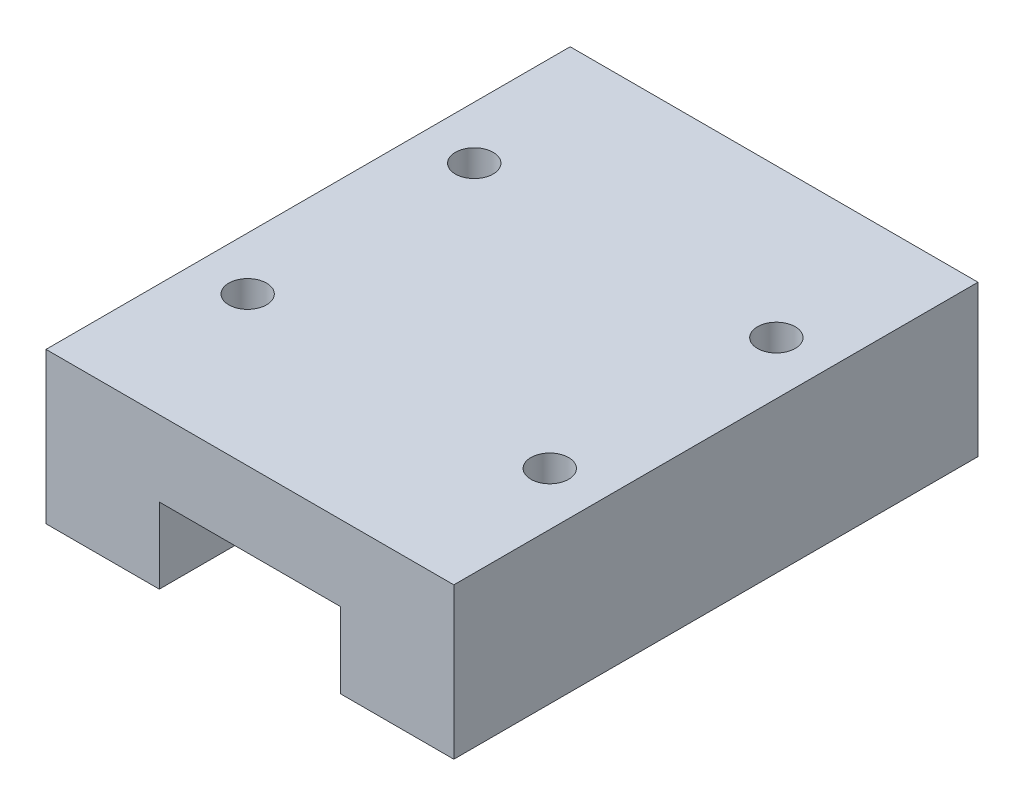
ISO-10303-21;
HEADER;
FILE_DESCRIPTION(('STEP AP214'),'2;1');
FILE_NAME('part.step','',(''),(''),'','','');
FILE_SCHEMA(('AUTOMOTIVE_DESIGN { 1 0 10303 214 1 1 1 1 }'));
ENDSEC;
DATA;
#1=APPLICATION_CONTEXT('core data for automotive mechanical design processes');
#2=APPLICATION_PROTOCOL_DEFINITION('international standard','automotive_design',2000,#1);
#3=PRODUCT_CONTEXT('',#1,'mechanical');
#4=PRODUCT('Part','Part','',(#3));
#5=PRODUCT_RELATED_PRODUCT_CATEGORY('part','',(#4));
#6=PRODUCT_DEFINITION_FORMATION('','',#4);
#7=PRODUCT_DEFINITION_CONTEXT('part definition',#1,'design');
#8=PRODUCT_DEFINITION('design','',#6,#7);
#9=PRODUCT_DEFINITION_SHAPE('','',#8);
#10=(LENGTH_UNIT() NAMED_UNIT(*) SI_UNIT(.MILLI.,.METRE.));
#11=(NAMED_UNIT(*) PLANE_ANGLE_UNIT() SI_UNIT($,.RADIAN.));
#12=(NAMED_UNIT(*) SI_UNIT($,.STERADIAN.) SOLID_ANGLE_UNIT());
#13=UNCERTAINTY_MEASURE_WITH_UNIT(LENGTH_MEASURE(1.E-05),#10,'distance_accuracy_value','');
#14=(GEOMETRIC_REPRESENTATION_CONTEXT(3) GLOBAL_UNCERTAINTY_ASSIGNED_CONTEXT((#13)) GLOBAL_UNIT_ASSIGNED_CONTEXT((#10,
#11,#12)) REPRESENTATION_CONTEXT('',''));
#15=CARTESIAN_POINT('',(0.,0.,0.));
#16=DIRECTION('',(0.,0.,1.));
#17=DIRECTION('',(1.,0.,0.));
#18=AXIS2_PLACEMENT_3D('',#15,#16,#17);
#19=CARTESIAN_POINT('',(7.5,0.,34.7));
#20=DIRECTION('',(0.,1.,0.));
#21=DIRECTION('',(-1.,0.,0.));
#22=AXIS2_PLACEMENT_3D('',#19,#20,#21);
#23=PLANE('',#22);
#24=DIRECTION('',(1.,0.,0.));
#25=VECTOR('',#24,1.);
#26=CARTESIAN_POINT('',(7.5,0.,0.));
#27=LINE('',#26,#25);
#28=CARTESIAN_POINT('',(0.,0.,0.));
#29=VERTEX_POINT('',#28);
#30=CARTESIAN_POINT('',(7.5,0.,0.));
#31=VERTEX_POINT('',#30);
#32=EDGE_CURVE('E148',#29,#31,#27,.T.);
#33=ORIENTED_EDGE('',*,*,#32,.T.);
#34=DIRECTION('',(0.,0.,-1.));
#35=VECTOR('',#34,1.);
#36=CARTESIAN_POINT('',(7.5,0.,34.7));
#37=LINE('',#36,#35);
#38=CARTESIAN_POINT('',(7.5,0.,34.7));
#39=VERTEX_POINT('',#38);
#40=EDGE_CURVE('E11',#39,#31,#37,.T.);
#41=ORIENTED_EDGE('',*,*,#40,.F.);
#42=DIRECTION('',(1.,0.,0.));
#43=VECTOR('',#42,1.);
#44=CARTESIAN_POINT('',(7.5,0.,34.7));
#45=LINE('',#44,#43);
#46=CARTESIAN_POINT('',(0.,0.,34.7));
#47=VERTEX_POINT('',#46);
#48=EDGE_CURVE('E170',#47,#39,#45,.T.);
#49=ORIENTED_EDGE('',*,*,#48,.F.);
#50=DIRECTION('',(0.,0.,-1.));
#51=VECTOR('',#50,1.);
#52=CARTESIAN_POINT('',(0.,0.,34.7));
#53=LINE('',#52,#51);
#54=EDGE_CURVE('E144',#47,#29,#53,.T.);
#55=ORIENTED_EDGE('',*,*,#54,.T.);
#56=EDGE_LOOP('',(#33,#41,#49,#55));
#57=FACE_BOUND('',#56,.T.);
#58=ADVANCED_FACE('F42',(#57),#23,.F.);
#59=CARTESIAN_POINT('',(7.5,5.,34.7));
#60=DIRECTION('',(-1.,0.,0.));
#61=DIRECTION('',(0.,-1.,0.));
#62=AXIS2_PLACEMENT_3D('',#59,#60,#61);
#63=PLANE('',#62);
#64=DIRECTION('',(0.,1.,0.));
#65=VECTOR('',#64,1.);
#66=CARTESIAN_POINT('',(7.5,5.,0.));
#67=LINE('',#66,#65);
#68=CARTESIAN_POINT('',(7.5,5.,0.));
#69=VERTEX_POINT('',#68);
#70=EDGE_CURVE('E152',#31,#69,#67,.T.);
#71=ORIENTED_EDGE('',*,*,#70,.T.);
#72=DIRECTION('',(0.,0.,-1.));
#73=VECTOR('',#72,1.);
#74=CARTESIAN_POINT('',(7.5,5.,34.7));
#75=LINE('',#74,#73);
#76=CARTESIAN_POINT('',(7.5,5.,34.7));
#77=VERTEX_POINT('',#76);
#78=EDGE_CURVE('E51',#77,#69,#75,.T.);
#79=ORIENTED_EDGE('',*,*,#78,.F.);
#80=DIRECTION('',(0.,1.,0.));
#81=VECTOR('',#80,1.);
#82=CARTESIAN_POINT('',(7.5,5.,34.7));
#83=LINE('',#82,#81);
#84=EDGE_CURVE('E103',#39,#77,#83,.T.);
#85=ORIENTED_EDGE('',*,*,#84,.F.);
#86=ORIENTED_EDGE('',*,*,#40,.T.);
#87=EDGE_LOOP('',(#71,#79,#85,#86));
#88=FACE_BOUND('',#87,.T.);
#89=ADVANCED_FACE('F274',(#88),#63,.F.);
#90=CARTESIAN_POINT('',(19.5,5.,34.7));
#91=DIRECTION('',(0.,1.,0.));
#92=DIRECTION('',(-1.,0.,0.));
#93=AXIS2_PLACEMENT_3D('',#90,#91,#92);
#94=PLANE('',#93);
#95=DIRECTION('',(1.,0.,0.));
#96=VECTOR('',#95,1.);
#97=CARTESIAN_POINT('',(19.5,5.,0.));
#98=LINE('',#97,#96);
#99=CARTESIAN_POINT('',(19.5,5.,0.));
#100=VERTEX_POINT('',#99);
#101=EDGE_CURVE('E155',#69,#100,#98,.T.);
#102=ORIENTED_EDGE('',*,*,#101,.T.);
#103=DIRECTION('',(0.,0.,-1.));
#104=VECTOR('',#103,1.);
#105=CARTESIAN_POINT('',(19.5,5.,34.7));
#106=LINE('',#105,#104);
#107=CARTESIAN_POINT('',(19.5,5.,34.7));
#108=VERTEX_POINT('',#107);
#109=EDGE_CURVE('E180',#108,#100,#106,.T.);
#110=ORIENTED_EDGE('',*,*,#109,.F.);
#111=DIRECTION('',(1.,0.,0.));
#112=VECTOR('',#111,1.);
#113=CARTESIAN_POINT('',(19.5,5.,34.7));
#114=LINE('',#113,#112);
#115=EDGE_CURVE('E191',#77,#108,#114,.T.);
#116=ORIENTED_EDGE('',*,*,#115,.F.);
#117=ORIENTED_EDGE('',*,*,#78,.T.);
#118=EDGE_LOOP('',(#102,#110,#116,#117));
#119=FACE_BOUND('',#118,.T.);
#120=ADVANCED_FACE('F189',(#119),#94,.F.);
#121=CARTESIAN_POINT('',(19.5,0.,34.7));
#122=DIRECTION('',(1.,0.,0.));
#123=DIRECTION('',(0.,0.,-1.));
#124=AXIS2_PLACEMENT_3D('',#121,#122,#123);
#125=PLANE('',#124);
#126=DIRECTION('',(0.,-1.,0.));
#127=VECTOR('',#126,1.);
#128=CARTESIAN_POINT('',(19.5,0.,0.));
#129=LINE('',#128,#127);
#130=CARTESIAN_POINT('',(19.5,0.,0.));
#131=VERTEX_POINT('',#130);
#132=EDGE_CURVE('E158',#100,#131,#129,.T.);
#133=ORIENTED_EDGE('',*,*,#132,.T.);
#134=DIRECTION('',(0.,0.,-1.));
#135=VECTOR('',#134,1.);
#136=CARTESIAN_POINT('',(19.5,0.,34.7));
#137=LINE('',#136,#135);
#138=CARTESIAN_POINT('',(19.5,0.,34.7));
#139=VERTEX_POINT('',#138);
#140=EDGE_CURVE('E176',#139,#131,#137,.T.);
#141=ORIENTED_EDGE('',*,*,#140,.F.);
#142=DIRECTION('',(0.,-1.,0.));
#143=VECTOR('',#142,1.);
#144=CARTESIAN_POINT('',(19.5,0.,34.7));
#145=LINE('',#144,#143);
#146=EDGE_CURVE('E204',#108,#139,#145,.T.);
#147=ORIENTED_EDGE('',*,*,#146,.F.);
#148=ORIENTED_EDGE('',*,*,#109,.T.);
#149=EDGE_LOOP('',(#133,#141,#147,#148));
#150=FACE_BOUND('',#149,.T.);
#151=ADVANCED_FACE('F199',(#150),#125,.F.);
#152=CARTESIAN_POINT('',(27.,0.,34.7));
#153=DIRECTION('',(0.,1.,0.));
#154=DIRECTION('',(-1.,0.,0.));
#155=AXIS2_PLACEMENT_3D('',#152,#153,#154);
#156=PLANE('',#155);
#157=DIRECTION('',(1.,0.,0.));
#158=VECTOR('',#157,1.);
#159=CARTESIAN_POINT('',(27.,0.,0.));
#160=LINE('',#159,#158);
#161=CARTESIAN_POINT('',(27.,0.,0.));
#162=VERTEX_POINT('',#161);
#163=EDGE_CURVE('E161',#131,#162,#160,.T.);
#164=ORIENTED_EDGE('',*,*,#163,.T.);
#165=DIRECTION('',(0.,0.,-1.));
#166=VECTOR('',#165,1.);
#167=CARTESIAN_POINT('',(27.,0.,34.7));
#168=LINE('',#167,#166);
#169=CARTESIAN_POINT('',(27.,0.,34.7));
#170=VERTEX_POINT('',#169);
#171=EDGE_CURVE('E135',#170,#162,#168,.T.);
#172=ORIENTED_EDGE('',*,*,#171,.F.);
#173=DIRECTION('',(1.,0.,0.));
#174=VECTOR('',#173,1.);
#175=CARTESIAN_POINT('',(27.,0.,34.7));
#176=LINE('',#175,#174);
#177=EDGE_CURVE('E124',#139,#170,#176,.T.);
#178=ORIENTED_EDGE('',*,*,#177,.F.);
#179=ORIENTED_EDGE('',*,*,#140,.T.);
#180=EDGE_LOOP('',(#164,#172,#178,#179));
#181=FACE_BOUND('',#180,.T.);
#182=ADVANCED_FACE('F202',(#181),#156,.F.);
#183=CARTESIAN_POINT('',(27.,10.,34.7));
#184=DIRECTION('',(-1.,0.,0.));
#185=DIRECTION('',(0.,0.,1.));
#186=AXIS2_PLACEMENT_3D('',#183,#184,#185);
#187=PLANE('',#186);
#188=DIRECTION('',(0.,1.,0.));
#189=VECTOR('',#188,1.);
#190=CARTESIAN_POINT('',(27.,10.,0.));
#191=LINE('',#190,#189);
#192=CARTESIAN_POINT('',(27.,10.,0.));
#193=VERTEX_POINT('',#192);
#194=EDGE_CURVE('E133',#162,#193,#191,.T.);
#195=ORIENTED_EDGE('',*,*,#194,.T.);
#196=DIRECTION('',(0.,0.,-1.));
#197=VECTOR('',#196,1.);
#198=CARTESIAN_POINT('',(27.,10.,34.7));
#199=LINE('',#198,#197);
#200=CARTESIAN_POINT('',(27.,10.,34.7));
#201=VERTEX_POINT('',#200);
#202=EDGE_CURVE('E130',#201,#193,#199,.T.);
#203=ORIENTED_EDGE('',*,*,#202,.F.);
#204=DIRECTION('',(0.,1.,0.));
#205=VECTOR('',#204,1.);
#206=CARTESIAN_POINT('',(27.,10.,34.7));
#207=LINE('',#206,#205);
#208=EDGE_CURVE('E118',#170,#201,#207,.T.);
#209=ORIENTED_EDGE('',*,*,#208,.F.);
#210=ORIENTED_EDGE('',*,*,#171,.T.);
#211=EDGE_LOOP('',(#195,#203,#209,#210));
#212=FACE_BOUND('',#211,.T.);
#213=ADVANCED_FACE('F131',(#212),#187,.F.);
#214=CARTESIAN_POINT('',(0.,10.,34.7));
#215=DIRECTION('',(0.,-1.,0.));
#216=DIRECTION('',(1.,0.,0.));
#217=AXIS2_PLACEMENT_3D('',#214,#215,#216);
#218=PLANE('',#217);
#219=CARTESIAN_POINT('',(3.5,10.,9.85));
#220=DIRECTION('',(0.,1.,0.));
#221=DIRECTION('',(0.,0.,1.));
#222=AXIS2_PLACEMENT_3D('',#219,#220,#221);
#223=CIRCLE('',#222,1.24999999999999);
#224=CARTESIAN_POINT('',(3.5,10.,11.1));
#225=VERTEX_POINT('',#224);
#226=EDGE_CURVE('E241',#225,#225,#223,.T.);
#227=ORIENTED_EDGE('',*,*,#226,.F.);
#228=EDGE_LOOP('',(#227));
#229=FACE_BOUND('',#228,.T.);
#230=CARTESIAN_POINT('',(3.50000000000001,10.,24.85));
#231=DIRECTION('',(0.,1.,0.));
#232=DIRECTION('',(0.,0.,1.));
#233=AXIS2_PLACEMENT_3D('',#230,#231,#232);
#234=CIRCLE('',#233,1.24999999999999);
#235=CARTESIAN_POINT('',(3.50000000000001,10.,26.1));
#236=VERTEX_POINT('',#235);
#237=EDGE_CURVE('E233',#236,#236,#234,.T.);
#238=ORIENTED_EDGE('',*,*,#237,.F.);
#239=EDGE_LOOP('',(#238));
#240=FACE_BOUND('',#239,.T.);
#241=CARTESIAN_POINT('',(23.5,10.,24.85));
#242=DIRECTION('',(0.,1.,0.));
#243=DIRECTION('',(0.,0.,1.));
#244=AXIS2_PLACEMENT_3D('',#241,#242,#243);
#245=CIRCLE('',#244,1.24999999999999);
#246=CARTESIAN_POINT('',(23.5,10.,26.1));
#247=VERTEX_POINT('',#246);
#248=EDGE_CURVE('E225',#247,#247,#245,.T.);
#249=ORIENTED_EDGE('',*,*,#248,.F.);
#250=EDGE_LOOP('',(#249));
#251=FACE_BOUND('',#250,.T.);
#252=CARTESIAN_POINT('',(23.5,10.,9.85));
#253=DIRECTION('',(0.,1.,0.));
#254=DIRECTION('',(0.,0.,1.));
#255=AXIS2_PLACEMENT_3D('',#252,#253,#254);
#256=CIRCLE('',#255,1.24999999999999);
#257=CARTESIAN_POINT('',(23.5,10.,11.1));
#258=VERTEX_POINT('',#257);
#259=EDGE_CURVE('E217',#258,#258,#256,.T.);
#260=ORIENTED_EDGE('',*,*,#259,.F.);
#261=EDGE_LOOP('',(#260));
#262=FACE_BOUND('',#261,.T.);
#263=DIRECTION('',(-1.,0.,0.));
#264=VECTOR('',#263,1.);
#265=CARTESIAN_POINT('',(0.,10.,0.));
#266=LINE('',#265,#264);
#267=CARTESIAN_POINT('',(0.,10.,0.));
#268=VERTEX_POINT('',#267);
#269=EDGE_CURVE('E89',#193,#268,#266,.T.);
#270=ORIENTED_EDGE('',*,*,#269,.T.);
#271=DIRECTION('',(0.,0.,-1.));
#272=VECTOR('',#271,1.);
#273=CARTESIAN_POINT('',(0.,10.,34.7));
#274=LINE('',#273,#272);
#275=CARTESIAN_POINT('',(0.,10.,34.7));
#276=VERTEX_POINT('',#275);
#277=EDGE_CURVE('E136',#276,#268,#274,.T.);
#278=ORIENTED_EDGE('',*,*,#277,.F.);
#279=DIRECTION('',(-1.,0.,0.));
#280=VECTOR('',#279,1.);
#281=CARTESIAN_POINT('',(0.,10.,34.7));
#282=LINE('',#281,#280);
#283=EDGE_CURVE('E122',#201,#276,#282,.T.);
#284=ORIENTED_EDGE('',*,*,#283,.F.);
#285=ORIENTED_EDGE('',*,*,#202,.T.);
#286=EDGE_LOOP('',(#270,#278,#284,#285));
#287=FACE_BOUND('',#286,.T.);
#288=ADVANCED_FACE('F138',(#229,#240,#251,#262,#287),#218,.F.);
#289=CARTESIAN_POINT('',(0.,0.,34.7));
#290=DIRECTION('',(1.,0.,0.));
#291=DIRECTION('',(0.,0.,-1.));
#292=AXIS2_PLACEMENT_3D('',#289,#290,#291);
#293=PLANE('',#292);
#294=DIRECTION('',(0.,-1.,0.));
#295=VECTOR('',#294,1.);
#296=CARTESIAN_POINT('',(0.,0.,0.));
#297=LINE('',#296,#295);
#298=EDGE_CURVE('E95',#268,#29,#297,.T.);
#299=ORIENTED_EDGE('',*,*,#298,.T.);
#300=ORIENTED_EDGE('',*,*,#54,.F.);
#301=DIRECTION('',(0.,-1.,0.));
#302=VECTOR('',#301,1.);
#303=CARTESIAN_POINT('',(0.,0.,34.7));
#304=LINE('',#303,#302);
#305=EDGE_CURVE('E59',#276,#47,#304,.T.);
#306=ORIENTED_EDGE('',*,*,#305,.F.);
#307=ORIENTED_EDGE('',*,*,#277,.T.);
#308=EDGE_LOOP('',(#299,#300,#306,#307));
#309=FACE_BOUND('',#308,.T.);
#310=ADVANCED_FACE('F249',(#309),#293,.F.);
#311=CARTESIAN_POINT('',(0.,0.,34.7));
#312=DIRECTION('',(0.,0.,-1.));
#313=DIRECTION('',(-1.,0.,0.));
#314=AXIS2_PLACEMENT_3D('',#311,#312,#313);
#315=PLANE('',#314);
#316=ORIENTED_EDGE('',*,*,#48,.T.);
#317=ORIENTED_EDGE('',*,*,#84,.T.);
#318=ORIENTED_EDGE('',*,*,#115,.T.);
#319=ORIENTED_EDGE('',*,*,#146,.T.);
#320=ORIENTED_EDGE('',*,*,#177,.T.);
#321=ORIENTED_EDGE('',*,*,#208,.T.);
#322=ORIENTED_EDGE('',*,*,#283,.T.);
#323=ORIENTED_EDGE('',*,*,#305,.T.);
#324=EDGE_LOOP('',(#316,#317,#318,#319,#320,#321,#322,#323));
#325=FACE_BOUND('',#324,.T.);
#326=ADVANCED_FACE('F120',(#325),#315,.F.);
#327=CARTESIAN_POINT('',(0.,0.,0.));
#328=DIRECTION('',(0.,0.,-1.));
#329=DIRECTION('',(-1.,0.,0.));
#330=AXIS2_PLACEMENT_3D('',#327,#328,#329);
#331=PLANE('',#330);
#332=ORIENTED_EDGE('',*,*,#32,.F.);
#333=ORIENTED_EDGE('',*,*,#298,.F.);
#334=ORIENTED_EDGE('',*,*,#269,.F.);
#335=ORIENTED_EDGE('',*,*,#194,.F.);
#336=ORIENTED_EDGE('',*,*,#163,.F.);
#337=ORIENTED_EDGE('',*,*,#132,.F.);
#338=ORIENTED_EDGE('',*,*,#101,.F.);
#339=ORIENTED_EDGE('',*,*,#70,.F.);
#340=EDGE_LOOP('',(#332,#333,#334,#335,#336,#337,#338,#339));
#341=FACE_BOUND('',#340,.T.);
#342=ADVANCED_FACE('F195',(#341),#331,.T.);
#343=CARTESIAN_POINT('',(23.5,4.,9.85));
#344=DIRECTION('',(0.,1.,0.));
#345=DIRECTION('',(0.,0.,1.));
#346=AXIS2_PLACEMENT_3D('',#343,#344,#345);
#347=CONICAL_SURFACE('',#346,1.25,1.02974425867665);
#348=CARTESIAN_POINT('',(23.5,3.24892422621555,9.85));
#349=VERTEX_POINT('',#348);
#350=VERTEX_LOOP('',#349);
#351=FACE_BOUND('',#350,.T.);
#352=CARTESIAN_POINT('',(23.5,4.,9.85));
#353=DIRECTION('',(0.,1.,0.));
#354=DIRECTION('',(0.,0.,1.));
#355=AXIS2_PLACEMENT_3D('',#352,#353,#354);
#356=CIRCLE('',#355,1.25);
#357=CARTESIAN_POINT('',(23.5,4.,11.1));
#358=VERTEX_POINT('',#357);
#359=EDGE_CURVE('E153',#358,#358,#356,.T.);
#360=ORIENTED_EDGE('',*,*,#359,.T.);
#361=EDGE_LOOP('',(#360));
#362=FACE_BOUND('',#361,.T.);
#363=ADVANCED_FACE('F260',(#351,#362),#347,.F.);
#364=CARTESIAN_POINT('',(23.5,10.,9.85));
#365=DIRECTION('',(0.,1.,0.));
#366=DIRECTION('',(0.,0.,1.));
#367=AXIS2_PLACEMENT_3D('',#364,#365,#366);
#368=CYLINDRICAL_SURFACE('',#367,1.24999999999999);
#369=ORIENTED_EDGE('',*,*,#359,.F.);
#370=EDGE_LOOP('',(#369));
#371=FACE_BOUND('',#370,.T.);
#372=ORIENTED_EDGE('',*,*,#259,.T.);
#373=EDGE_LOOP('',(#372));
#374=FACE_BOUND('',#373,.T.);
#375=ADVANCED_FACE('F257',(#371,#374),#368,.F.);
#376=CARTESIAN_POINT('',(23.5,4.,24.85));
#377=DIRECTION('',(0.,1.,0.));
#378=DIRECTION('',(0.,0.,1.));
#379=AXIS2_PLACEMENT_3D('',#376,#377,#378);
#380=CONICAL_SURFACE('',#379,1.25,1.02974425867665);
#381=CARTESIAN_POINT('',(23.5,3.24892422621555,24.85));
#382=VERTEX_POINT('',#381);
#383=VERTEX_LOOP('',#382);
#384=FACE_BOUND('',#383,.T.);
#385=CARTESIAN_POINT('',(23.5,4.,24.85));
#386=DIRECTION('',(0.,1.,0.));
#387=DIRECTION('',(0.,0.,1.));
#388=AXIS2_PLACEMENT_3D('',#385,#386,#387);
#389=CIRCLE('',#388,1.25);
#390=CARTESIAN_POINT('',(23.5,4.,26.1));
#391=VERTEX_POINT('',#390);
#392=EDGE_CURVE('E221',#391,#391,#389,.T.);
#393=ORIENTED_EDGE('',*,*,#392,.T.);
#394=EDGE_LOOP('',(#393));
#395=FACE_BOUND('',#394,.T.);
#396=ADVANCED_FACE('F259',(#384,#395),#380,.F.);
#397=CARTESIAN_POINT('',(23.5,10.,24.85));
#398=DIRECTION('',(0.,1.,0.));
#399=DIRECTION('',(0.,0.,1.));
#400=AXIS2_PLACEMENT_3D('',#397,#398,#399);
#401=CYLINDRICAL_SURFACE('',#400,1.24999999999999);
#402=ORIENTED_EDGE('',*,*,#392,.F.);
#403=EDGE_LOOP('',(#402));
#404=FACE_BOUND('',#403,.T.);
#405=ORIENTED_EDGE('',*,*,#248,.T.);
#406=EDGE_LOOP('',(#405));
#407=FACE_BOUND('',#406,.T.);
#408=ADVANCED_FACE('F267',(#404,#407),#401,.F.);
#409=CARTESIAN_POINT('',(3.50000000000001,4.,24.85));
#410=DIRECTION('',(0.,1.,0.));
#411=DIRECTION('',(0.,0.,1.));
#412=AXIS2_PLACEMENT_3D('',#409,#410,#411);
#413=CONICAL_SURFACE('',#412,1.25,1.02974425867665);
#414=CARTESIAN_POINT('',(3.50000000000001,3.24892422621555,24.85));
#415=VERTEX_POINT('',#414);
#416=VERTEX_LOOP('',#415);
#417=FACE_BOUND('',#416,.T.);
#418=CARTESIAN_POINT('',(3.50000000000001,4.,24.85));
#419=DIRECTION('',(0.,1.,0.));
#420=DIRECTION('',(0.,0.,1.));
#421=AXIS2_PLACEMENT_3D('',#418,#419,#420);
#422=CIRCLE('',#421,1.25);
#423=CARTESIAN_POINT('',(3.50000000000001,4.,26.1));
#424=VERTEX_POINT('',#423);
#425=EDGE_CURVE('E229',#424,#424,#422,.T.);
#426=ORIENTED_EDGE('',*,*,#425,.T.);
#427=EDGE_LOOP('',(#426));
#428=FACE_BOUND('',#427,.T.);
#429=ADVANCED_FACE('F350',(#417,#428),#413,.F.);
#430=CARTESIAN_POINT('',(3.50000000000001,10.,24.85));
#431=DIRECTION('',(0.,1.,0.));
#432=DIRECTION('',(0.,0.,1.));
#433=AXIS2_PLACEMENT_3D('',#430,#431,#432);
#434=CYLINDRICAL_SURFACE('',#433,1.24999999999999);
#435=ORIENTED_EDGE('',*,*,#425,.F.);
#436=EDGE_LOOP('',(#435));
#437=FACE_BOUND('',#436,.T.);
#438=ORIENTED_EDGE('',*,*,#237,.T.);
#439=EDGE_LOOP('',(#438));
#440=FACE_BOUND('',#439,.T.);
#441=ADVANCED_FACE('F360',(#437,#440),#434,.F.);
#442=CARTESIAN_POINT('',(3.5,4.,9.85));
#443=DIRECTION('',(0.,1.,0.));
#444=DIRECTION('',(0.,0.,1.));
#445=AXIS2_PLACEMENT_3D('',#442,#443,#444);
#446=CONICAL_SURFACE('',#445,1.25,1.02974425867665);
#447=CARTESIAN_POINT('',(3.5,3.24892422621555,9.85));
#448=VERTEX_POINT('',#447);
#449=VERTEX_LOOP('',#448);
#450=FACE_BOUND('',#449,.T.);
#451=CARTESIAN_POINT('',(3.5,4.,9.85));
#452=DIRECTION('',(0.,1.,0.));
#453=DIRECTION('',(0.,0.,1.));
#454=AXIS2_PLACEMENT_3D('',#451,#452,#453);
#455=CIRCLE('',#454,1.25);
#456=CARTESIAN_POINT('',(3.5,4.,11.1));
#457=VERTEX_POINT('',#456);
#458=EDGE_CURVE('E237',#457,#457,#455,.T.);
#459=ORIENTED_EDGE('',*,*,#458,.T.);
#460=EDGE_LOOP('',(#459));
#461=FACE_BOUND('',#460,.T.);
#462=ADVANCED_FACE('F369',(#450,#461),#446,.F.);
#463=CARTESIAN_POINT('',(3.5,10.,9.85));
#464=DIRECTION('',(0.,1.,0.));
#465=DIRECTION('',(0.,0.,1.));
#466=AXIS2_PLACEMENT_3D('',#463,#464,#465);
#467=CYLINDRICAL_SURFACE('',#466,1.24999999999999);
#468=ORIENTED_EDGE('',*,*,#458,.F.);
#469=EDGE_LOOP('',(#468));
#470=FACE_BOUND('',#469,.T.);
#471=ORIENTED_EDGE('',*,*,#226,.T.);
#472=EDGE_LOOP('',(#471));
#473=FACE_BOUND('',#472,.T.);
#474=ADVANCED_FACE('F245',(#470,#473),#467,.F.);
#475=CLOSED_SHELL('',(#58,#89,#120,#151,#182,#213,#288,#310,#326,#342,#363,#375,#396,#408,#429,
#441,#462,#474));
#476=MANIFOLD_SOLID_BREP('B2',#475);
#477=ADVANCED_BREP_SHAPE_REPRESENTATION('',(#18,#476),#14);
#478=SHAPE_DEFINITION_REPRESENTATION(#9,#477);
ENDSEC;
END-ISO-10303-21;
